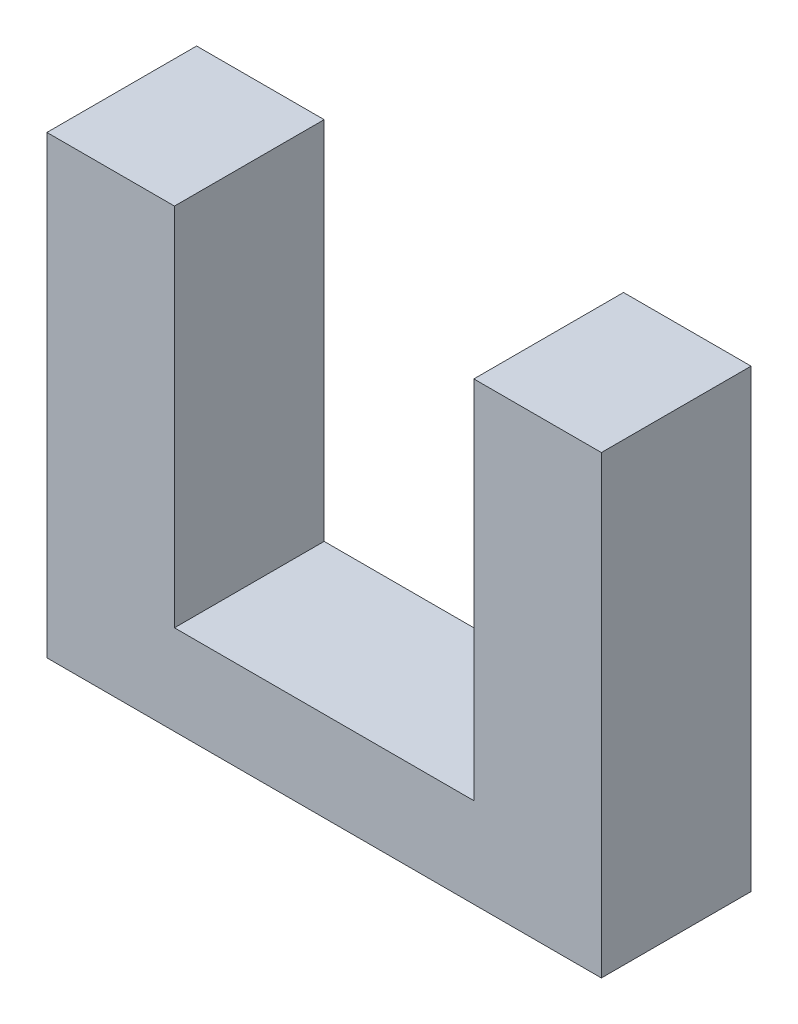
ISO-10303-21;
HEADER;
FILE_DESCRIPTION(('STEP AP214'),'2;1');
FILE_NAME('part.step','',(''),(''),'','','');
FILE_SCHEMA(('AUTOMOTIVE_DESIGN { 1 0 10303 214 1 1 1 1 }'));
ENDSEC;
DATA;
#1=APPLICATION_CONTEXT('core data for automotive mechanical design processes');
#2=APPLICATION_PROTOCOL_DEFINITION('international standard','automotive_design',2000,#1);
#3=PRODUCT_CONTEXT('',#1,'mechanical');
#4=PRODUCT('Part','Part','',(#3));
#5=PRODUCT_RELATED_PRODUCT_CATEGORY('part','',(#4));
#6=PRODUCT_DEFINITION_FORMATION('','',#4);
#7=PRODUCT_DEFINITION_CONTEXT('part definition',#1,'design');
#8=PRODUCT_DEFINITION('design','',#6,#7);
#9=PRODUCT_DEFINITION_SHAPE('','',#8);
#10=(LENGTH_UNIT() NAMED_UNIT(*) SI_UNIT(.MILLI.,.METRE.));
#11=(NAMED_UNIT(*) PLANE_ANGLE_UNIT() SI_UNIT($,.RADIAN.));
#12=(NAMED_UNIT(*) SI_UNIT($,.STERADIAN.) SOLID_ANGLE_UNIT());
#13=UNCERTAINTY_MEASURE_WITH_UNIT(LENGTH_MEASURE(1.E-05),#10,'distance_accuracy_value','');
#14=(GEOMETRIC_REPRESENTATION_CONTEXT(3) GLOBAL_UNCERTAINTY_ASSIGNED_CONTEXT((#13)) GLOBAL_UNIT_ASSIGNED_CONTEXT((#10,
#11,#12)) REPRESENTATION_CONTEXT('',''));
#15=CARTESIAN_POINT('',(0.,0.,0.));
#16=DIRECTION('',(0.,0.,1.));
#17=DIRECTION('',(1.,0.,0.));
#18=AXIS2_PLACEMENT_3D('',#15,#16,#17);
#19=CARTESIAN_POINT('',(9.26,-3.,2.5));
#20=DIRECTION('',(0.,1.,0.));
#21=DIRECTION('',(-1.,0.,0.));
#22=AXIS2_PLACEMENT_3D('',#19,#20,#21);
#23=PLANE('',#22);
#24=CARTESIAN_POINT('',(0.,-3.,0.));
#25=DIRECTION('',(0.,1.,0.));
#26=DIRECTION('',(-1.,0.,0.));
#27=AXIS2_PLACEMENT_3D('',#24,#25,#26);
#28=CIRCLE('',#27,0.715);
#29=CARTESIAN_POINT('',(-0.715,-3.,0.));
#30=VERTEX_POINT('',#29);
#31=EDGE_CURVE('E11',#30,#30,#28,.F.);
#32=ORIENTED_EDGE('',*,*,#31,.F.);
#33=EDGE_LOOP('',(#32));
#34=FACE_BOUND('',#33,.T.);
#35=DIRECTION('',(1.,0.,0.));
#36=VECTOR('',#35,1.);
#37=CARTESIAN_POINT('',(9.26,-3.,-2.5));
#38=LINE('',#37,#36);
#39=CARTESIAN_POINT('',(-9.26,-3.,-2.5));
#40=VERTEX_POINT('',#39);
#41=CARTESIAN_POINT('',(9.26,-3.,-2.5));
#42=VERTEX_POINT('',#41);
#43=EDGE_CURVE('E130',#40,#42,#38,.T.);
#44=ORIENTED_EDGE('',*,*,#43,.T.);
#45=DIRECTION('',(0.,0.,-1.));
#46=VECTOR('',#45,1.);
#47=CARTESIAN_POINT('',(9.26,-3.,2.5));
#48=LINE('',#47,#46);
#49=CARTESIAN_POINT('',(9.26,-3.,2.5));
#50=VERTEX_POINT('',#49);
#51=EDGE_CURVE('E41',#50,#42,#48,.T.);
#52=ORIENTED_EDGE('',*,*,#51,.F.);
#53=DIRECTION('',(1.,0.,0.));
#54=VECTOR('',#53,1.);
#55=CARTESIAN_POINT('',(9.26,-3.,2.5));
#56=LINE('',#55,#54);
#57=CARTESIAN_POINT('',(-9.26,-3.,2.5));
#58=VERTEX_POINT('',#57);
#59=EDGE_CURVE('E145',#58,#50,#56,.T.);
#60=ORIENTED_EDGE('',*,*,#59,.F.);
#61=DIRECTION('',(0.,0.,-1.));
#62=VECTOR('',#61,1.);
#63=CARTESIAN_POINT('',(-9.26,-3.,2.5));
#64=LINE('',#63,#62);
#65=EDGE_CURVE('E126',#58,#40,#64,.T.);
#66=ORIENTED_EDGE('',*,*,#65,.T.);
#67=EDGE_LOOP('',(#44,#52,#60,#66));
#68=FACE_BOUND('',#67,.T.);
#69=ADVANCED_FACE('F33',(#34,#68),#23,.F.);
#70=CARTESIAN_POINT('',(9.26,12.2,2.5));
#71=DIRECTION('',(-1.,0.,0.));
#72=DIRECTION('',(0.,-1.,0.));
#73=AXIS2_PLACEMENT_3D('',#70,#71,#72);
#74=PLANE('',#73);
#75=DIRECTION('',(0.,1.,0.));
#76=VECTOR('',#75,1.);
#77=CARTESIAN_POINT('',(9.26,12.2,-2.5));
#78=LINE('',#77,#76);
#79=CARTESIAN_POINT('',(9.26,12.2,-2.5));
#80=VERTEX_POINT('',#79);
#81=EDGE_CURVE('E133',#42,#80,#78,.T.);
#82=ORIENTED_EDGE('',*,*,#81,.T.);
#83=DIRECTION('',(0.,0.,-1.));
#84=VECTOR('',#83,1.);
#85=CARTESIAN_POINT('',(9.26,12.2,2.5));
#86=LINE('',#85,#84);
#87=CARTESIAN_POINT('',(9.26,12.2,2.5));
#88=VERTEX_POINT('',#87);
#89=EDGE_CURVE('E155',#88,#80,#86,.T.);
#90=ORIENTED_EDGE('',*,*,#89,.F.);
#91=DIRECTION('',(0.,1.,0.));
#92=VECTOR('',#91,1.);
#93=CARTESIAN_POINT('',(9.26,12.2,2.5));
#94=LINE('',#93,#92);
#95=EDGE_CURVE('E93',#50,#88,#94,.T.);
#96=ORIENTED_EDGE('',*,*,#95,.F.);
#97=ORIENTED_EDGE('',*,*,#51,.T.);
#98=EDGE_LOOP('',(#82,#90,#96,#97));
#99=FACE_BOUND('',#98,.T.);
#100=ADVANCED_FACE('F158',(#99),#74,.F.);
#101=CARTESIAN_POINT('',(5.,12.2,2.5));
#102=DIRECTION('',(0.,-1.,0.));
#103=DIRECTION('',(0.,0.,-1.));
#104=AXIS2_PLACEMENT_3D('',#101,#102,#103);
#105=PLANE('',#104);
#106=DIRECTION('',(-1.,0.,0.));
#107=VECTOR('',#106,1.);
#108=CARTESIAN_POINT('',(5.,12.2,-2.5));
#109=LINE('',#108,#107);
#110=CARTESIAN_POINT('',(5.,12.2,-2.5));
#111=VERTEX_POINT('',#110);
#112=EDGE_CURVE('E136',#80,#111,#109,.T.);
#113=ORIENTED_EDGE('',*,*,#112,.T.);
#114=DIRECTION('',(0.,0.,-1.));
#115=VECTOR('',#114,1.);
#116=CARTESIAN_POINT('',(5.,12.2,2.5));
#117=LINE('',#116,#115);
#118=CARTESIAN_POINT('',(5.,12.2,2.5));
#119=VERTEX_POINT('',#118);
#120=EDGE_CURVE('E152',#119,#111,#117,.T.);
#121=ORIENTED_EDGE('',*,*,#120,.F.);
#122=DIRECTION('',(-1.,0.,0.));
#123=VECTOR('',#122,1.);
#124=CARTESIAN_POINT('',(5.,12.2,2.5));
#125=LINE('',#124,#123);
#126=EDGE_CURVE('E176',#88,#119,#125,.T.);
#127=ORIENTED_EDGE('',*,*,#126,.F.);
#128=ORIENTED_EDGE('',*,*,#89,.T.);
#129=EDGE_LOOP('',(#113,#121,#127,#128));
#130=FACE_BOUND('',#129,.T.);
#131=ADVANCED_FACE('F169',(#130),#105,.F.);
#132=CARTESIAN_POINT('',(5.,0.,2.5));
#133=DIRECTION('',(1.,0.,0.));
#134=DIRECTION('',(0.,1.,0.));
#135=AXIS2_PLACEMENT_3D('',#132,#133,#134);
#136=PLANE('',#135);
#137=DIRECTION('',(0.,-1.,0.));
#138=VECTOR('',#137,1.);
#139=CARTESIAN_POINT('',(5.,0.,-2.5));
#140=LINE('',#139,#138);
#141=CARTESIAN_POINT('',(5.,0.,-2.5));
#142=VERTEX_POINT('',#141);
#143=EDGE_CURVE('E138',#111,#142,#140,.T.);
#144=ORIENTED_EDGE('',*,*,#143,.T.);
#145=DIRECTION('',(0.,0.,-1.));
#146=VECTOR('',#145,1.);
#147=CARTESIAN_POINT('',(5.,0.,2.5));
#148=LINE('',#147,#146);
#149=CARTESIAN_POINT('',(5.,0.,2.5));
#150=VERTEX_POINT('',#149);
#151=EDGE_CURVE('E149',#150,#142,#148,.T.);
#152=ORIENTED_EDGE('',*,*,#151,.F.);
#153=DIRECTION('',(0.,-1.,0.));
#154=VECTOR('',#153,1.);
#155=CARTESIAN_POINT('',(5.,0.,2.5));
#156=LINE('',#155,#154);
#157=EDGE_CURVE('E175',#119,#150,#156,.T.);
#158=ORIENTED_EDGE('',*,*,#157,.F.);
#159=ORIENTED_EDGE('',*,*,#120,.T.);
#160=EDGE_LOOP('',(#144,#152,#158,#159));
#161=FACE_BOUND('',#160,.T.);
#162=ADVANCED_FACE('F173',(#161),#136,.F.);
#163=CARTESIAN_POINT('',(-5.,0.,2.5));
#164=DIRECTION('',(0.,-1.,0.));
#165=DIRECTION('',(1.,0.,0.));
#166=AXIS2_PLACEMENT_3D('',#163,#164,#165);
#167=PLANE('',#166);
#168=DIRECTION('',(-1.,0.,0.));
#169=VECTOR('',#168,1.);
#170=CARTESIAN_POINT('',(-5.,0.,-2.5));
#171=LINE('',#170,#169);
#172=CARTESIAN_POINT('',(-5.,0.,-2.5));
#173=VERTEX_POINT('',#172);
#174=EDGE_CURVE('E140',#142,#173,#171,.T.);
#175=ORIENTED_EDGE('',*,*,#174,.T.);
#176=DIRECTION('',(0.,0.,-1.));
#177=VECTOR('',#176,1.);
#178=CARTESIAN_POINT('',(-5.,0.,2.5));
#179=LINE('',#178,#177);
#180=CARTESIAN_POINT('',(-5.,0.,2.5));
#181=VERTEX_POINT('',#180);
#182=EDGE_CURVE('E121',#181,#173,#179,.T.);
#183=ORIENTED_EDGE('',*,*,#182,.F.);
#184=DIRECTION('',(-1.,0.,0.));
#185=VECTOR('',#184,1.);
#186=CARTESIAN_POINT('',(-5.,0.,2.5));
#187=LINE('',#186,#185);
#188=EDGE_CURVE('E112',#150,#181,#187,.T.);
#189=ORIENTED_EDGE('',*,*,#188,.F.);
#190=ORIENTED_EDGE('',*,*,#151,.T.);
#191=EDGE_LOOP('',(#175,#183,#189,#190));
#192=FACE_BOUND('',#191,.T.);
#193=ADVANCED_FACE('F204',(#192),#167,.F.);
#194=CARTESIAN_POINT('',(-5.,12.2,2.5));
#195=DIRECTION('',(-1.,0.,0.));
#196=DIRECTION('',(0.,-1.,0.));
#197=AXIS2_PLACEMENT_3D('',#194,#195,#196);
#198=PLANE('',#197);
#199=DIRECTION('',(0.,1.,0.));
#200=VECTOR('',#199,1.);
#201=CARTESIAN_POINT('',(-5.,12.2,-2.5));
#202=LINE('',#201,#200);
#203=CARTESIAN_POINT('',(-5.,12.2,-2.5));
#204=VERTEX_POINT('',#203);
#205=EDGE_CURVE('E120',#173,#204,#202,.T.);
#206=ORIENTED_EDGE('',*,*,#205,.T.);
#207=DIRECTION('',(0.,0.,-1.));
#208=VECTOR('',#207,1.);
#209=CARTESIAN_POINT('',(-5.,12.2,2.5));
#210=LINE('',#209,#208);
#211=CARTESIAN_POINT('',(-5.,12.2,2.5));
#212=VERTEX_POINT('',#211);
#213=EDGE_CURVE('E117',#212,#204,#210,.T.);
#214=ORIENTED_EDGE('',*,*,#213,.F.);
#215=DIRECTION('',(0.,1.,0.));
#216=VECTOR('',#215,1.);
#217=CARTESIAN_POINT('',(-5.,12.2,2.5));
#218=LINE('',#217,#216);
#219=EDGE_CURVE('E106',#181,#212,#218,.T.);
#220=ORIENTED_EDGE('',*,*,#219,.F.);
#221=ORIENTED_EDGE('',*,*,#182,.T.);
#222=EDGE_LOOP('',(#206,#214,#220,#221));
#223=FACE_BOUND('',#222,.T.);
#224=ADVANCED_FACE('F118',(#223),#198,.F.);
#225=CARTESIAN_POINT('',(-9.26,12.2,2.5));
#226=DIRECTION('',(0.,-1.,0.));
#227=DIRECTION('',(0.,0.,-1.));
#228=AXIS2_PLACEMENT_3D('',#225,#226,#227);
#229=PLANE('',#228);
#230=DIRECTION('',(-1.,0.,0.));
#231=VECTOR('',#230,1.);
#232=CARTESIAN_POINT('',(-9.26,12.2,-2.5));
#233=LINE('',#232,#231);
#234=CARTESIAN_POINT('',(-9.26,12.2,-2.5));
#235=VERTEX_POINT('',#234);
#236=EDGE_CURVE('E78',#204,#235,#233,.T.);
#237=ORIENTED_EDGE('',*,*,#236,.T.);
#238=DIRECTION('',(0.,0.,-1.));
#239=VECTOR('',#238,1.);
#240=CARTESIAN_POINT('',(-9.26,12.2,2.5));
#241=LINE('',#240,#239);
#242=CARTESIAN_POINT('',(-9.26,12.2,2.5));
#243=VERTEX_POINT('',#242);
#244=EDGE_CURVE('E122',#243,#235,#241,.T.);
#245=ORIENTED_EDGE('',*,*,#244,.F.);
#246=DIRECTION('',(-1.,0.,0.));
#247=VECTOR('',#246,1.);
#248=CARTESIAN_POINT('',(-9.26,12.2,2.5));
#249=LINE('',#248,#247);
#250=EDGE_CURVE('E110',#212,#243,#249,.T.);
#251=ORIENTED_EDGE('',*,*,#250,.F.);
#252=ORIENTED_EDGE('',*,*,#213,.T.);
#253=EDGE_LOOP('',(#237,#245,#251,#252));
#254=FACE_BOUND('',#253,.T.);
#255=ADVANCED_FACE('F124',(#254),#229,.F.);
#256=CARTESIAN_POINT('',(-9.26,-3.,2.5));
#257=DIRECTION('',(1.,0.,0.));
#258=DIRECTION('',(0.,0.,-1.));
#259=AXIS2_PLACEMENT_3D('',#256,#257,#258);
#260=PLANE('',#259);
#261=DIRECTION('',(0.,-1.,0.));
#262=VECTOR('',#261,1.);
#263=CARTESIAN_POINT('',(-9.26,-3.,-2.5));
#264=LINE('',#263,#262);
#265=EDGE_CURVE('E84',#235,#40,#264,.T.);
#266=ORIENTED_EDGE('',*,*,#265,.T.);
#267=ORIENTED_EDGE('',*,*,#65,.F.);
#268=DIRECTION('',(0.,-1.,0.));
#269=VECTOR('',#268,1.);
#270=CARTESIAN_POINT('',(-9.26,-3.,2.5));
#271=LINE('',#270,#269);
#272=EDGE_CURVE('E49',#243,#58,#271,.T.);
#273=ORIENTED_EDGE('',*,*,#272,.F.);
#274=ORIENTED_EDGE('',*,*,#244,.T.);
#275=EDGE_LOOP('',(#266,#267,#273,#274));
#276=FACE_BOUND('',#275,.T.);
#277=ADVANCED_FACE('F212',(#276),#260,.F.);
#278=CARTESIAN_POINT('',(0.,0.,2.5));
#279=DIRECTION('',(0.,0.,-1.));
#280=DIRECTION('',(-1.,0.,0.));
#281=AXIS2_PLACEMENT_3D('',#278,#279,#280);
#282=PLANE('',#281);
#283=ORIENTED_EDGE('',*,*,#59,.T.);
#284=ORIENTED_EDGE('',*,*,#95,.T.);
#285=ORIENTED_EDGE('',*,*,#126,.T.);
#286=ORIENTED_EDGE('',*,*,#157,.T.);
#287=ORIENTED_EDGE('',*,*,#188,.T.);
#288=ORIENTED_EDGE('',*,*,#219,.T.);
#289=ORIENTED_EDGE('',*,*,#250,.T.);
#290=ORIENTED_EDGE('',*,*,#272,.T.);
#291=EDGE_LOOP('',(#283,#284,#285,#286,#287,#288,#289,#290));
#292=FACE_BOUND('',#291,.T.);
#293=ADVANCED_FACE('F108',(#292),#282,.F.);
#294=CARTESIAN_POINT('',(0.,0.,-2.5));
#295=DIRECTION('',(0.,0.,-1.));
#296=DIRECTION('',(-1.,0.,0.));
#297=AXIS2_PLACEMENT_3D('',#294,#295,#296);
#298=PLANE('',#297);
#299=ORIENTED_EDGE('',*,*,#43,.F.);
#300=ORIENTED_EDGE('',*,*,#265,.F.);
#301=ORIENTED_EDGE('',*,*,#236,.F.);
#302=ORIENTED_EDGE('',*,*,#205,.F.);
#303=ORIENTED_EDGE('',*,*,#174,.F.);
#304=ORIENTED_EDGE('',*,*,#143,.F.);
#305=ORIENTED_EDGE('',*,*,#112,.F.);
#306=ORIENTED_EDGE('',*,*,#81,.F.);
#307=EDGE_LOOP('',(#299,#300,#301,#302,#303,#304,#305,#306));
#308=FACE_BOUND('',#307,.T.);
#309=ADVANCED_FACE('F163',(#308),#298,.T.);
#310=CARTESIAN_POINT('',(0.,-4.3,0.));
#311=DIRECTION('',(0.,1.,0.));
#312=DIRECTION('',(0.,0.,1.));
#313=AXIS2_PLACEMENT_3D('',#310,#311,#312);
#314=CYLINDRICAL_SURFACE('',#313,0.715);
#315=CARTESIAN_POINT('',(0.,-4.3,0.));
#316=DIRECTION('',(0.,-1.,0.));
#317=DIRECTION('',(0.,0.,-1.));
#318=AXIS2_PLACEMENT_3D('',#315,#316,#317);
#319=CIRCLE('',#318,0.715);
#320=CARTESIAN_POINT('',(0.,-4.3,-0.715));
#321=VERTEX_POINT('',#320);
#322=EDGE_CURVE('E134',#321,#321,#319,.T.);
#323=ORIENTED_EDGE('',*,*,#322,.F.);
#324=EDGE_LOOP('',(#323));
#325=FACE_BOUND('',#324,.T.);
#326=ORIENTED_EDGE('',*,*,#31,.T.);
#327=EDGE_LOOP('',(#326));
#328=FACE_BOUND('',#327,.T.);
#329=ADVANCED_FACE('F187',(#325,#328),#314,.T.);
#330=CARTESIAN_POINT('',(0.,-4.3,0.));
#331=DIRECTION('',(0.,-1.,0.));
#332=DIRECTION('',(0.,0.,-1.));
#333=AXIS2_PLACEMENT_3D('',#330,#331,#332);
#334=PLANE('',#333);
#335=ORIENTED_EDGE('',*,*,#322,.T.);
#336=EDGE_LOOP('',(#335));
#337=FACE_BOUND('',#336,.T.);
#338=ADVANCED_FACE('F185',(#337),#334,.T.);
#339=CLOSED_SHELL('',(#69,#100,#131,#162,#193,#224,#255,#277,#293,#309,#329,#338));
#340=MANIFOLD_SOLID_BREP('B2',#339);
#341=ADVANCED_BREP_SHAPE_REPRESENTATION('',(#18,#340),#14);
#342=SHAPE_DEFINITION_REPRESENTATION(#9,#341);
ENDSEC;
END-ISO-10303-21;
